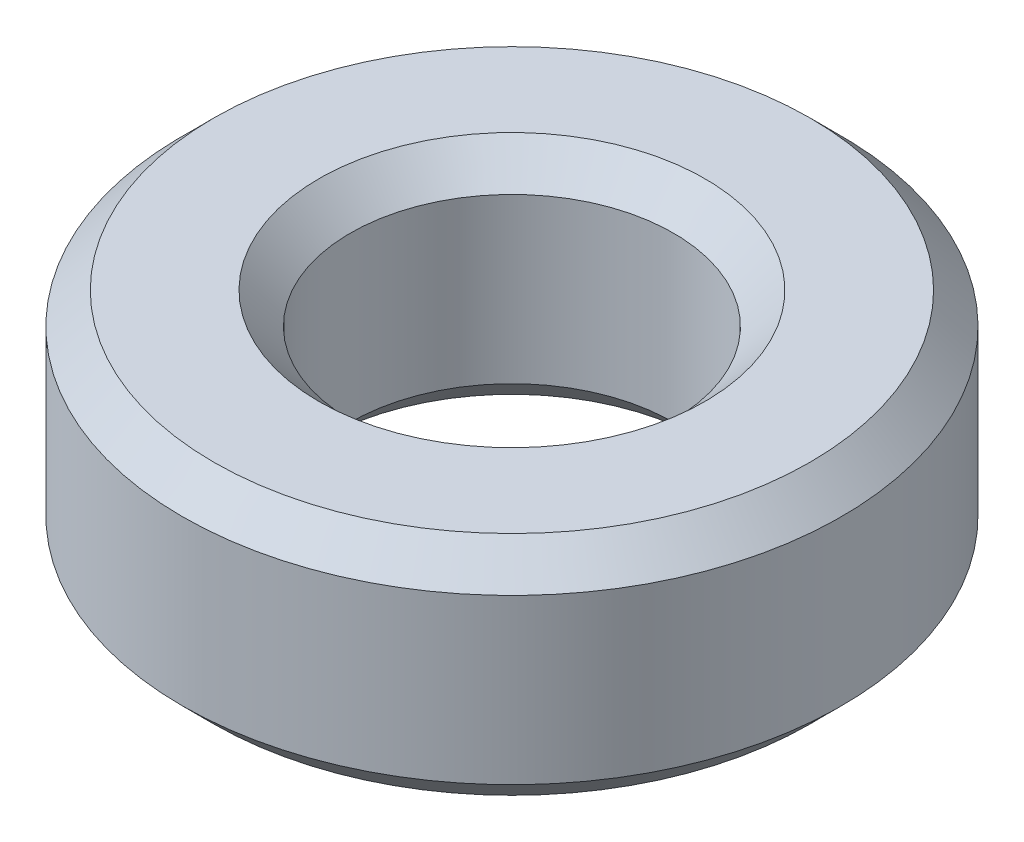
ISO-10303-21;
HEADER;
FILE_DESCRIPTION(('STEP AP214'),'2;1');
FILE_NAME('part.step','',(''),(''),'','','');
FILE_SCHEMA(('AUTOMOTIVE_DESIGN { 1 0 10303 214 1 1 1 1 }'));
ENDSEC;
DATA;
#1=APPLICATION_CONTEXT('core data for automotive mechanical design processes');
#2=APPLICATION_PROTOCOL_DEFINITION('international standard','automotive_design',2000,#1);
#3=PRODUCT_CONTEXT('',#1,'mechanical');
#4=PRODUCT('Part','Part','',(#3));
#5=PRODUCT_RELATED_PRODUCT_CATEGORY('part','',(#4));
#6=PRODUCT_DEFINITION_FORMATION('','',#4);
#7=PRODUCT_DEFINITION_CONTEXT('part definition',#1,'design');
#8=PRODUCT_DEFINITION('design','',#6,#7);
#9=PRODUCT_DEFINITION_SHAPE('','',#8);
#10=(LENGTH_UNIT() NAMED_UNIT(*) SI_UNIT(.MILLI.,.METRE.));
#11=(NAMED_UNIT(*) PLANE_ANGLE_UNIT() SI_UNIT($,.RADIAN.));
#12=(NAMED_UNIT(*) SI_UNIT($,.STERADIAN.) SOLID_ANGLE_UNIT());
#13=UNCERTAINTY_MEASURE_WITH_UNIT(LENGTH_MEASURE(1.E-05),#10,'distance_accuracy_value','');
#14=(GEOMETRIC_REPRESENTATION_CONTEXT(3) GLOBAL_UNCERTAINTY_ASSIGNED_CONTEXT((#13)) GLOBAL_UNIT_ASSIGNED_CONTEXT((#10,
#11,#12)) REPRESENTATION_CONTEXT('',''));
#15=CARTESIAN_POINT('',(0.,0.,0.));
#16=DIRECTION('',(0.,0.,1.));
#17=DIRECTION('',(1.,0.,0.));
#18=AXIS2_PLACEMENT_3D('',#15,#16,#17);
#19=CARTESIAN_POINT('',(0.,20.6379494865356,0.));
#20=DIRECTION('',(0.,-1.,0.));
#21=DIRECTION('',(0.,0.,-1.));
#22=AXIS2_PLACEMENT_3D('',#19,#20,#21);
#23=CYLINDRICAL_SURFACE('',#22,30.);
#24=CARTESIAN_POINT('',(0.,2.85925234465516,0.));
#25=DIRECTION('',(0.,1.,0.));
#26=DIRECTION('',(0.,0.,1.));
#27=AXIS2_PLACEMENT_3D('',#24,#25,#26);
#28=CIRCLE('',#27,30.);
#29=CARTESIAN_POINT('',(0.,2.85925234465516,30.));
#30=VERTEX_POINT('',#29);
#31=EDGE_CURVE('E10',#30,#30,#28,.T.);
#32=ORIENTED_EDGE('',*,*,#31,.T.);
#33=EDGE_LOOP('',(#32));
#34=FACE_BOUND('',#33,.T.);
#35=CARTESIAN_POINT('',(0.,17.7786971418804,0.));
#36=DIRECTION('',(0.,1.,0.));
#37=DIRECTION('',(0.,0.,1.));
#38=AXIS2_PLACEMENT_3D('',#35,#36,#37);
#39=CIRCLE('',#38,30.);
#40=CARTESIAN_POINT('',(0.,17.7786971418804,30.));
#41=VERTEX_POINT('',#40);
#42=EDGE_CURVE('E50',#41,#41,#39,.F.);
#43=ORIENTED_EDGE('',*,*,#42,.T.);
#44=EDGE_LOOP('',(#43));
#45=FACE_BOUND('',#44,.T.);
#46=ADVANCED_FACE('F39',(#34,#45),#23,.T.);
#47=CARTESIAN_POINT('',(0.,20.6379494865356,0.));
#48=DIRECTION('',(0.,1.,0.));
#49=DIRECTION('',(0.,0.,1.));
#50=AXIS2_PLACEMENT_3D('',#47,#48,#49);
#51=PLANE('',#50);
#52=CARTESIAN_POINT('',(0.,20.6379494865356,0.));
#53=DIRECTION('',(0.,1.,0.));
#54=DIRECTION('',(0.,0.,1.));
#55=AXIS2_PLACEMENT_3D('',#52,#53,#54);
#56=CIRCLE('',#55,17.5701202061106);
#57=CARTESIAN_POINT('',(0.,20.6379494865356,17.5701202061106));
#58=VERTEX_POINT('',#57);
#59=EDGE_CURVE('E58',#58,#58,#56,.F.);
#60=ORIENTED_EDGE('',*,*,#59,.T.);
#61=EDGE_LOOP('',(#60));
#62=FACE_BOUND('',#61,.T.);
#63=CARTESIAN_POINT('',(0.,20.6379494865356,0.));
#64=DIRECTION('',(0.,1.,0.));
#65=DIRECTION('',(0.,0.,1.));
#66=AXIS2_PLACEMENT_3D('',#63,#64,#65);
#67=CIRCLE('',#66,27.1407476553448);
#68=CARTESIAN_POINT('',(0.,20.6379494865356,27.1407476553448));
#69=VERTEX_POINT('',#68);
#70=EDGE_CURVE('E61',#69,#69,#67,.T.);
#71=ORIENTED_EDGE('',*,*,#70,.T.);
#72=EDGE_LOOP('',(#71));
#73=FACE_BOUND('',#72,.T.);
#74=ADVANCED_FACE('F88',(#62,#73),#51,.T.);
#75=CARTESIAN_POINT('',(0.,0.,0.));
#76=DIRECTION('',(0.,1.,0.));
#77=DIRECTION('',(0.,0.,1.));
#78=AXIS2_PLACEMENT_3D('',#75,#76,#77);
#79=PLANE('',#78);
#80=CARTESIAN_POINT('',(0.,0.,0.));
#81=DIRECTION('',(0.,1.,0.));
#82=DIRECTION('',(0.,0.,1.));
#83=AXIS2_PLACEMENT_3D('',#80,#81,#82);
#84=CIRCLE('',#83,17.5701202061105);
#85=CARTESIAN_POINT('',(0.,0.,17.5701202061105));
#86=VERTEX_POINT('',#85);
#87=EDGE_CURVE('E51',#86,#86,#84,.T.);
#88=ORIENTED_EDGE('',*,*,#87,.T.);
#89=EDGE_LOOP('',(#88));
#90=FACE_BOUND('',#89,.T.);
#91=CARTESIAN_POINT('',(0.,0.,0.));
#92=DIRECTION('',(0.,1.,0.));
#93=DIRECTION('',(0.,0.,1.));
#94=AXIS2_PLACEMENT_3D('',#91,#92,#93);
#95=CIRCLE('',#94,27.1407476553448);
#96=CARTESIAN_POINT('',(0.,0.,27.1407476553448));
#97=VERTEX_POINT('',#96);
#98=EDGE_CURVE('E54',#97,#97,#95,.F.);
#99=ORIENTED_EDGE('',*,*,#98,.T.);
#100=EDGE_LOOP('',(#99));
#101=FACE_BOUND('',#100,.T.);
#102=ADVANCED_FACE('F83',(#90,#101),#79,.F.);
#103=CARTESIAN_POINT('',(0.,20.6379494865356,0.));
#104=DIRECTION('',(0.,-1.,0.));
#105=DIRECTION('',(0.,0.,-1.));
#106=AXIS2_PLACEMENT_3D('',#103,#104,#105);
#107=CYLINDRICAL_SURFACE('',#106,14.7108678614554);
#108=CARTESIAN_POINT('',(0.,17.7786971418804,0.));
#109=DIRECTION('',(0.,1.,0.));
#110=DIRECTION('',(0.,0.,1.));
#111=AXIS2_PLACEMENT_3D('',#108,#109,#110);
#112=CIRCLE('',#111,14.7108678614554);
#113=CARTESIAN_POINT('',(0.,17.7786971418804,14.7108678614554));
#114=VERTEX_POINT('',#113);
#115=EDGE_CURVE('E67',#114,#114,#112,.T.);
#116=ORIENTED_EDGE('',*,*,#115,.T.);
#117=EDGE_LOOP('',(#116));
#118=FACE_BOUND('',#117,.T.);
#119=CARTESIAN_POINT('',(0.,2.85925234465519,0.));
#120=DIRECTION('',(0.,1.,0.));
#121=DIRECTION('',(0.,0.,1.));
#122=AXIS2_PLACEMENT_3D('',#119,#120,#121);
#123=CIRCLE('',#122,14.7108678614554);
#124=CARTESIAN_POINT('',(0.,2.85925234465519,14.7108678614554));
#125=VERTEX_POINT('',#124);
#126=EDGE_CURVE('E69',#125,#125,#123,.F.);
#127=ORIENTED_EDGE('',*,*,#126,.T.);
#128=EDGE_LOOP('',(#127));
#129=FACE_BOUND('',#128,.T.);
#130=ADVANCED_FACE('F71',(#118,#129),#107,.F.);
#131=CARTESIAN_POINT('',(0.,17.7786971418804,0.));
#132=DIRECTION('',(0.,1.,0.));
#133=DIRECTION('',(0.,0.,1.));
#134=AXIS2_PLACEMENT_3D('',#131,#132,#133);
#135=CONICAL_SURFACE('',#134,14.7108678614554,0.785398163397451);
#136=ORIENTED_EDGE('',*,*,#59,.F.);
#137=EDGE_LOOP('',(#136));
#138=FACE_BOUND('',#137,.T.);
#139=ORIENTED_EDGE('',*,*,#115,.F.);
#140=EDGE_LOOP('',(#139));
#141=FACE_BOUND('',#140,.T.);
#142=ADVANCED_FACE('F77',(#138,#141),#135,.F.);
#143=CARTESIAN_POINT('',(0.,0.,0.));
#144=DIRECTION('',(0.,-1.,0.));
#145=DIRECTION('',(0.,0.,-1.));
#146=AXIS2_PLACEMENT_3D('',#143,#144,#145);
#147=CONICAL_SURFACE('',#146,17.5701202061105,0.785398163397443);
#148=ORIENTED_EDGE('',*,*,#126,.F.);
#149=EDGE_LOOP('',(#148));
#150=FACE_BOUND('',#149,.T.);
#151=ORIENTED_EDGE('',*,*,#87,.F.);
#152=EDGE_LOOP('',(#151));
#153=FACE_BOUND('',#152,.T.);
#154=ADVANCED_FACE('F73',(#150,#153),#147,.F.);
#155=CARTESIAN_POINT('',(0.,2.85925234465516,0.));
#156=DIRECTION('',(0.,1.,0.));
#157=DIRECTION('',(0.,0.,1.));
#158=AXIS2_PLACEMENT_3D('',#155,#156,#157);
#159=CONICAL_SURFACE('',#158,30.,0.785398163397452);
#160=ORIENTED_EDGE('',*,*,#98,.F.);
#161=EDGE_LOOP('',(#160));
#162=FACE_BOUND('',#161,.T.);
#163=ORIENTED_EDGE('',*,*,#31,.F.);
#164=EDGE_LOOP('',(#163));
#165=FACE_BOUND('',#164,.T.);
#166=ADVANCED_FACE('F76',(#162,#165),#159,.T.);
#167=CARTESIAN_POINT('',(0.,20.6379494865356,0.));
#168=DIRECTION('',(0.,-1.,0.));
#169=DIRECTION('',(0.,0.,-1.));
#170=AXIS2_PLACEMENT_3D('',#167,#168,#169);
#171=CONICAL_SURFACE('',#170,27.1407476553448,0.785398163397445);
#172=ORIENTED_EDGE('',*,*,#42,.F.);
#173=EDGE_LOOP('',(#172));
#174=FACE_BOUND('',#173,.T.);
#175=ORIENTED_EDGE('',*,*,#70,.F.);
#176=EDGE_LOOP('',(#175));
#177=FACE_BOUND('',#176,.T.);
#178=ADVANCED_FACE('F45',(#174,#177),#171,.T.);
#179=CLOSED_SHELL('',(#46,#74,#102,#130,#142,#154,#166,#178));
#180=MANIFOLD_SOLID_BREP('B2',#179);
#181=ADVANCED_BREP_SHAPE_REPRESENTATION('',(#18,#180),#14);
#182=SHAPE_DEFINITION_REPRESENTATION(#9,#181);
ENDSEC;
END-ISO-10303-21;
